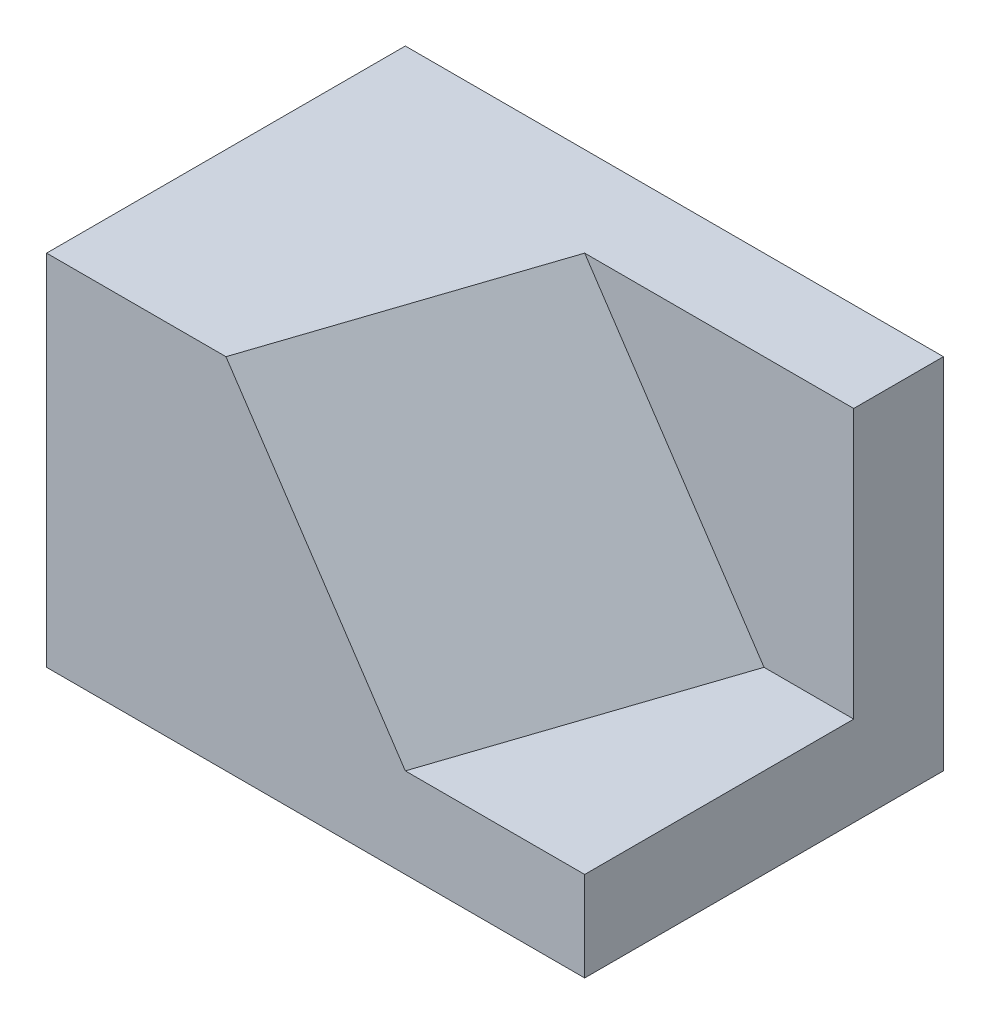
ISO-10303-21;
HEADER;
FILE_DESCRIPTION(('STEP AP214'),'2;1');
FILE_NAME('part.step','',(''),(''),'','','');
FILE_SCHEMA(('AUTOMOTIVE_DESIGN { 1 0 10303 214 1 1 1 1 }'));
ENDSEC;
DATA;
#1=APPLICATION_CONTEXT('core data for automotive mechanical design processes');
#2=APPLICATION_PROTOCOL_DEFINITION('international standard','automotive_design',2000,#1);
#3=PRODUCT_CONTEXT('',#1,'mechanical');
#4=PRODUCT('Part','Part','',(#3));
#5=PRODUCT_RELATED_PRODUCT_CATEGORY('part','',(#4));
#6=PRODUCT_DEFINITION_FORMATION('','',#4);
#7=PRODUCT_DEFINITION_CONTEXT('part definition',#1,'design');
#8=PRODUCT_DEFINITION('design','',#6,#7);
#9=PRODUCT_DEFINITION_SHAPE('','',#8);
#10=(LENGTH_UNIT() NAMED_UNIT(*) SI_UNIT(.MILLI.,.METRE.));
#11=(NAMED_UNIT(*) PLANE_ANGLE_UNIT() SI_UNIT($,.RADIAN.));
#12=(NAMED_UNIT(*) SI_UNIT($,.STERADIAN.) SOLID_ANGLE_UNIT());
#13=UNCERTAINTY_MEASURE_WITH_UNIT(LENGTH_MEASURE(1.E-05),#10,'distance_accuracy_value','');
#14=(GEOMETRIC_REPRESENTATION_CONTEXT(3) GLOBAL_UNCERTAINTY_ASSIGNED_CONTEXT((#13)) GLOBAL_UNIT_ASSIGNED_CONTEXT((#10,
#11,#12)) REPRESENTATION_CONTEXT('',''));
#15=CARTESIAN_POINT('',(0.,0.,0.));
#16=DIRECTION('',(0.,0.,1.));
#17=DIRECTION('',(1.,0.,0.));
#18=AXIS2_PLACEMENT_3D('',#15,#16,#17);
#19=CARTESIAN_POINT('',(-15.,20.,-10.));
#20=DIRECTION('',(1.,0.,0.));
#21=DIRECTION('',(0.,0.,-1.));
#22=AXIS2_PLACEMENT_3D('',#19,#20,#21);
#23=PLANE('',#22);
#24=DIRECTION('',(0.,0.,1.));
#25=VECTOR('',#24,1.);
#26=CARTESIAN_POINT('',(-15.,0.,-10.));
#27=LINE('',#26,#25);
#28=CARTESIAN_POINT('',(-15.,0.,-10.));
#29=VERTEX_POINT('',#28);
#30=CARTESIAN_POINT('',(-15.,0.,10.));
#31=VERTEX_POINT('',#30);
#32=EDGE_CURVE('E135',#29,#31,#27,.T.);
#33=ORIENTED_EDGE('',*,*,#32,.T.);
#34=DIRECTION('',(0.,-1.,0.));
#35=VECTOR('',#34,1.);
#36=CARTESIAN_POINT('',(-15.,20.,10.));
#37=LINE('',#36,#35);
#38=CARTESIAN_POINT('',(-15.,20.,10.));
#39=VERTEX_POINT('',#38);
#40=EDGE_CURVE('E11',#39,#31,#37,.T.);
#41=ORIENTED_EDGE('',*,*,#40,.F.);
#42=DIRECTION('',(0.,0.,1.));
#43=VECTOR('',#42,1.);
#44=CARTESIAN_POINT('',(-15.,20.,-10.));
#45=LINE('',#44,#43);
#46=CARTESIAN_POINT('',(-15.,20.,-10.));
#47=VERTEX_POINT('',#46);
#48=EDGE_CURVE('E128',#47,#39,#45,.T.);
#49=ORIENTED_EDGE('',*,*,#48,.F.);
#50=DIRECTION('',(0.,-1.,0.));
#51=VECTOR('',#50,1.);
#52=CARTESIAN_POINT('',(-15.,20.,-10.));
#53=LINE('',#52,#51);
#54=EDGE_CURVE('E134',#47,#29,#53,.T.);
#55=ORIENTED_EDGE('',*,*,#54,.T.);
#56=EDGE_LOOP('',(#33,#41,#49,#55));
#57=FACE_BOUND('',#56,.T.);
#58=ADVANCED_FACE('F37',(#57),#23,.F.);
#59=CARTESIAN_POINT('',(15.,20.,10.));
#60=DIRECTION('',(0.,0.,-1.));
#61=DIRECTION('',(-1.,0.,0.));
#62=AXIS2_PLACEMENT_3D('',#59,#60,#61);
#63=PLANE('',#62);
#64=DIRECTION('',(1.,0.,0.));
#65=VECTOR('',#64,1.);
#66=CARTESIAN_POINT('',(-21.3353582731212,5.,10.));
#67=LINE('',#66,#65);
#68=CARTESIAN_POINT('',(5.,5.,10.));
#69=VERTEX_POINT('',#68);
#70=CARTESIAN_POINT('',(15.,5.,10.));
#71=VERTEX_POINT('',#70);
#72=EDGE_CURVE('E110',#69,#71,#67,.T.);
#73=ORIENTED_EDGE('',*,*,#72,.F.);
#74=DIRECTION('',(0.554700196225229,-0.832050294337844,0.));
#75=VECTOR('',#74,1.);
#76=CARTESIAN_POINT('',(-3.10318716096035,17.1547807414405,10.));
#77=LINE('',#76,#75);
#78=CARTESIAN_POINT('',(-4.99999999999999,20.,10.));
#79=VERTEX_POINT('',#78);
#80=EDGE_CURVE('E116',#79,#69,#77,.T.);
#81=ORIENTED_EDGE('',*,*,#80,.F.);
#82=DIRECTION('',(1.,0.,0.));
#83=VECTOR('',#82,1.);
#84=CARTESIAN_POINT('',(15.,20.,10.));
#85=LINE('',#84,#83);
#86=EDGE_CURVE('E86',#39,#79,#85,.T.);
#87=ORIENTED_EDGE('',*,*,#86,.F.);
#88=ORIENTED_EDGE('',*,*,#40,.T.);
#89=DIRECTION('',(1.,0.,0.));
#90=VECTOR('',#89,1.);
#91=CARTESIAN_POINT('',(15.,0.,10.));
#92=LINE('',#91,#90);
#93=CARTESIAN_POINT('',(15.,0.,10.));
#94=VERTEX_POINT('',#93);
#95=EDGE_CURVE('E138',#31,#94,#92,.T.);
#96=ORIENTED_EDGE('',*,*,#95,.T.);
#97=DIRECTION('',(0.,-1.,0.));
#98=VECTOR('',#97,1.);
#99=CARTESIAN_POINT('',(15.,20.,10.));
#100=LINE('',#99,#98);
#101=EDGE_CURVE('E44',#71,#94,#100,.T.);
#102=ORIENTED_EDGE('',*,*,#101,.F.);
#103=EDGE_LOOP('',(#73,#81,#87,#88,#96,#102));
#104=FACE_BOUND('',#103,.T.);
#105=ADVANCED_FACE('F122',(#104),#63,.F.);
#106=CARTESIAN_POINT('',(15.,20.,-10.));
#107=DIRECTION('',(-1.,0.,0.));
#108=DIRECTION('',(0.,0.,1.));
#109=AXIS2_PLACEMENT_3D('',#106,#107,#108);
#110=PLANE('',#109);
#111=DIRECTION('',(0.,1.,0.));
#112=VECTOR('',#111,1.);
#113=CARTESIAN_POINT('',(15.,20.,-5.));
#114=LINE('',#113,#112);
#115=CARTESIAN_POINT('',(15.,5.00000000000011,-5.00000000000001));
#116=VERTEX_POINT('',#115);
#117=CARTESIAN_POINT('',(15.,20.,-5.));
#118=VERTEX_POINT('',#117);
#119=EDGE_CURVE('E51',#116,#118,#114,.T.);
#120=ORIENTED_EDGE('',*,*,#119,.F.);
#121=DIRECTION('',(0.,0.,-1.));
#122=VECTOR('',#121,1.);
#123=CARTESIAN_POINT('',(15.,5.00000000000011,-5.00000000000001));
#124=LINE('',#123,#122);
#125=EDGE_CURVE('E149',#71,#116,#124,.T.);
#126=ORIENTED_EDGE('',*,*,#125,.F.);
#127=ORIENTED_EDGE('',*,*,#101,.T.);
#128=DIRECTION('',(0.,0.,-1.));
#129=VECTOR('',#128,1.);
#130=CARTESIAN_POINT('',(15.,0.,-10.));
#131=LINE('',#130,#129);
#132=CARTESIAN_POINT('',(15.,0.,-10.));
#133=VERTEX_POINT('',#132);
#134=EDGE_CURVE('E140',#94,#133,#131,.T.);
#135=ORIENTED_EDGE('',*,*,#134,.T.);
#136=DIRECTION('',(0.,-1.,0.));
#137=VECTOR('',#136,1.);
#138=CARTESIAN_POINT('',(15.,20.,-10.));
#139=LINE('',#138,#137);
#140=CARTESIAN_POINT('',(15.,20.,-10.));
#141=VERTEX_POINT('',#140);
#142=EDGE_CURVE('E144',#141,#133,#139,.T.);
#143=ORIENTED_EDGE('',*,*,#142,.F.);
#144=DIRECTION('',(0.,0.,-1.));
#145=VECTOR('',#144,1.);
#146=CARTESIAN_POINT('',(15.,20.,-10.));
#147=LINE('',#146,#145);
#148=EDGE_CURVE('E131',#118,#141,#147,.T.);
#149=ORIENTED_EDGE('',*,*,#148,.F.);
#150=EDGE_LOOP('',(#120,#126,#127,#135,#143,#149));
#151=FACE_BOUND('',#150,.T.);
#152=ADVANCED_FACE('F146',(#151),#110,.F.);
#153=CARTESIAN_POINT('',(15.,20.,-10.));
#154=DIRECTION('',(0.,0.,1.));
#155=DIRECTION('',(1.,0.,0.));
#156=AXIS2_PLACEMENT_3D('',#153,#154,#155);
#157=PLANE('',#156);
#158=DIRECTION('',(-1.,0.,0.));
#159=VECTOR('',#158,1.);
#160=CARTESIAN_POINT('',(15.,0.,-10.));
#161=LINE('',#160,#159);
#162=EDGE_CURVE('E80',#133,#29,#161,.T.);
#163=ORIENTED_EDGE('',*,*,#162,.T.);
#164=ORIENTED_EDGE('',*,*,#54,.F.);
#165=DIRECTION('',(-1.,0.,0.));
#166=VECTOR('',#165,1.);
#167=CARTESIAN_POINT('',(15.,20.,-10.));
#168=LINE('',#167,#166);
#169=EDGE_CURVE('E60',#141,#47,#168,.T.);
#170=ORIENTED_EDGE('',*,*,#169,.F.);
#171=ORIENTED_EDGE('',*,*,#142,.T.);
#172=EDGE_LOOP('',(#163,#164,#170,#171));
#173=FACE_BOUND('',#172,.T.);
#174=ADVANCED_FACE('F156',(#173),#157,.F.);
#175=CARTESIAN_POINT('',(0.,20.,0.));
#176=DIRECTION('',(0.,-1.,0.));
#177=DIRECTION('',(0.,0.,-1.));
#178=AXIS2_PLACEMENT_3D('',#175,#176,#177);
#179=PLANE('',#178);
#180=ORIENTED_EDGE('',*,*,#86,.T.);
#181=DIRECTION('',(-0.316227766016838,0.,0.948683298050514));
#182=VECTOR('',#181,1.);
#183=CARTESIAN_POINT('',(-6.63353582731211,20.,14.9006074819364));
#184=LINE('',#183,#182);
#185=CARTESIAN_POINT('',(0.,20.,-5.));
#186=VERTEX_POINT('',#185);
#187=EDGE_CURVE('E119',#186,#79,#184,.T.);
#188=ORIENTED_EDGE('',*,*,#187,.F.);
#189=DIRECTION('',(1.,0.,0.));
#190=VECTOR('',#189,1.);
#191=CARTESIAN_POINT('',(-21.3353582731212,20.,-4.99999999999999));
#192=LINE('',#191,#190);
#193=EDGE_CURVE('E159',#186,#118,#192,.T.);
#194=ORIENTED_EDGE('',*,*,#193,.T.);
#195=ORIENTED_EDGE('',*,*,#148,.T.);
#196=ORIENTED_EDGE('',*,*,#169,.T.);
#197=ORIENTED_EDGE('',*,*,#48,.T.);
#198=EDGE_LOOP('',(#180,#188,#194,#195,#196,#197));
#199=FACE_BOUND('',#198,.T.);
#200=ADVANCED_FACE('F158',(#199),#179,.F.);
#201=CARTESIAN_POINT('',(0.,0.,0.));
#202=DIRECTION('',(0.,-1.,0.));
#203=DIRECTION('',(0.,0.,-1.));
#204=AXIS2_PLACEMENT_3D('',#201,#202,#203);
#205=PLANE('',#204);
#206=ORIENTED_EDGE('',*,*,#32,.F.);
#207=ORIENTED_EDGE('',*,*,#162,.F.);
#208=ORIENTED_EDGE('',*,*,#134,.F.);
#209=ORIENTED_EDGE('',*,*,#95,.F.);
#210=EDGE_LOOP('',(#206,#207,#208,#209));
#211=FACE_BOUND('',#210,.T.);
#212=ADVANCED_FACE('F153',(#211),#205,.T.);
#213=CARTESIAN_POINT('',(7.5,5.,2.5));
#214=DIRECTION('',(-0.801783725737273,-0.534522483824849,-0.267261241912424));
#215=DIRECTION('',(0.554700196225229,-0.832050294337844,0.));
#216=AXIS2_PLACEMENT_3D('',#213,#214,#215);
#217=PLANE('',#216);
#218=ORIENTED_EDGE('',*,*,#187,.T.);
#219=ORIENTED_EDGE('',*,*,#80,.T.);
#220=DIRECTION('',(0.316227766016834,0.,-0.948683298050515));
#221=VECTOR('',#220,1.);
#222=CARTESIAN_POINT('',(6.8664641726879,5.00000000000004,4.40060748193622));
#223=LINE('',#222,#221);
#224=CARTESIAN_POINT('',(9.99999999999993,5.00000000000011,-5.00000000000001));
#225=VERTEX_POINT('',#224);
#226=EDGE_CURVE('E105',#69,#225,#223,.T.);
#227=ORIENTED_EDGE('',*,*,#226,.T.);
#228=DIRECTION('',(-0.554700196225229,0.832050294337844,0.));
#229=VECTOR('',#228,1.);
#230=CARTESIAN_POINT('',(-6.56472562249882,29.8470884337482,-5.));
#231=LINE('',#230,#229);
#232=EDGE_CURVE('E160',#225,#186,#231,.T.);
#233=ORIENTED_EDGE('',*,*,#232,.T.);
#234=EDGE_LOOP('',(#218,#219,#227,#233));
#235=FACE_BOUND('',#234,.T.);
#236=ADVANCED_FACE('F117',(#235),#217,.F.);
#237=CARTESIAN_POINT('',(-21.3353582731212,5.00000000000011,-5.));
#238=DIRECTION('',(0.,-1.,0.));
#239=DIRECTION('',(0.,0.,-1.));
#240=AXIS2_PLACEMENT_3D('',#237,#238,#239);
#241=PLANE('',#240);
#242=ORIENTED_EDGE('',*,*,#72,.T.);
#243=ORIENTED_EDGE('',*,*,#125,.T.);
#244=DIRECTION('',(1.,0.,0.));
#245=VECTOR('',#244,1.);
#246=CARTESIAN_POINT('',(-21.3353582731212,5.00000000000011,-5.));
#247=LINE('',#246,#245);
#248=EDGE_CURVE('E112',#225,#116,#247,.T.);
#249=ORIENTED_EDGE('',*,*,#248,.F.);
#250=ORIENTED_EDGE('',*,*,#226,.F.);
#251=EDGE_LOOP('',(#242,#243,#249,#250));
#252=FACE_BOUND('',#251,.T.);
#253=ADVANCED_FACE('F107',(#252),#241,.F.);
#254=CARTESIAN_POINT('',(-21.3353582731212,20.,-4.99999999999999));
#255=DIRECTION('',(0.,0.,-1.));
#256=DIRECTION('',(-1.,0.,0.));
#257=AXIS2_PLACEMENT_3D('',#254,#255,#256);
#258=PLANE('',#257);
#259=ORIENTED_EDGE('',*,*,#248,.T.);
#260=ORIENTED_EDGE('',*,*,#119,.T.);
#261=ORIENTED_EDGE('',*,*,#193,.F.);
#262=ORIENTED_EDGE('',*,*,#232,.F.);
#263=EDGE_LOOP('',(#259,#260,#261,#262));
#264=FACE_BOUND('',#263,.T.);
#265=ADVANCED_FACE('F165',(#264),#258,.F.);
#266=CLOSED_SHELL('',(#58,#105,#152,#174,#200,#212,#236,#253,#265));
#267=MANIFOLD_SOLID_BREP('B2',#266);
#268=ADVANCED_BREP_SHAPE_REPRESENTATION('',(#18,#267),#14);
#269=SHAPE_DEFINITION_REPRESENTATION(#9,#268);
ENDSEC;
END-ISO-10303-21;
